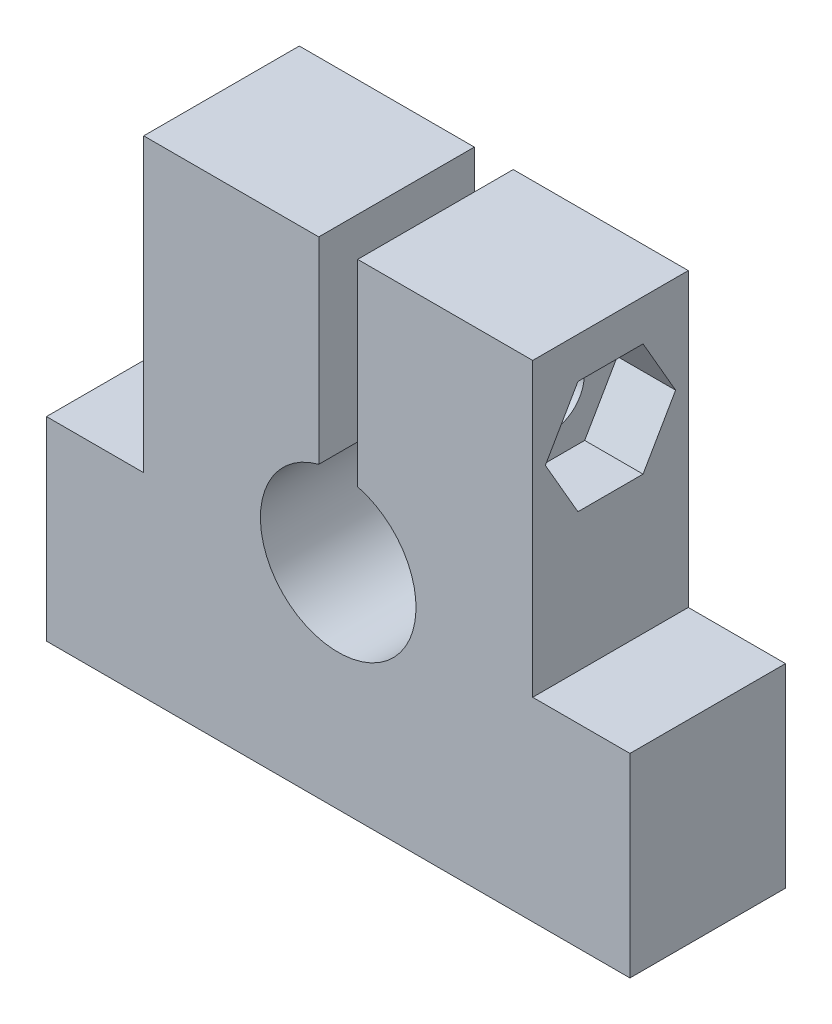
ISO-10303-21;
HEADER;
FILE_DESCRIPTION(('STEP AP214'),'2;1');
FILE_NAME('part.step','',(''),(''),'','','');
FILE_SCHEMA(('AUTOMOTIVE_DESIGN { 1 0 10303 214 1 1 1 1 }'));
ENDSEC;
DATA;
#1=APPLICATION_CONTEXT('core data for automotive mechanical design processes');
#2=APPLICATION_PROTOCOL_DEFINITION('international standard','automotive_design',2000,#1);
#3=PRODUCT_CONTEXT('',#1,'mechanical');
#4=PRODUCT('Part','Part','',(#3));
#5=PRODUCT_RELATED_PRODUCT_CATEGORY('part','',(#4));
#6=PRODUCT_DEFINITION_FORMATION('','',#4);
#7=PRODUCT_DEFINITION_CONTEXT('part definition',#1,'design');
#8=PRODUCT_DEFINITION('design','',#6,#7);
#9=PRODUCT_DEFINITION_SHAPE('','',#8);
#10=(LENGTH_UNIT() NAMED_UNIT(*) SI_UNIT(.MILLI.,.METRE.));
#11=(NAMED_UNIT(*) PLANE_ANGLE_UNIT() SI_UNIT($,.RADIAN.));
#12=(NAMED_UNIT(*) SI_UNIT($,.STERADIAN.) SOLID_ANGLE_UNIT());
#13=UNCERTAINTY_MEASURE_WITH_UNIT(LENGTH_MEASURE(1.E-05),#10,'distance_accuracy_value','');
#14=(GEOMETRIC_REPRESENTATION_CONTEXT(3) GLOBAL_UNCERTAINTY_ASSIGNED_CONTEXT((#13)) GLOBAL_UNIT_ASSIGNED_CONTEXT((#10,
#11,#12)) REPRESENTATION_CONTEXT('',''));
#15=CARTESIAN_POINT('',(0.,0.,0.));
#16=DIRECTION('',(0.,0.,1.));
#17=DIRECTION('',(1.,0.,0.));
#18=AXIS2_PLACEMENT_3D('',#15,#16,#17);
#19=CARTESIAN_POINT('',(15.,20.,4.));
#20=DIRECTION('',(-1.,0.,0.));
#21=DIRECTION('',(0.,-1.,0.));
#22=AXIS2_PLACEMENT_3D('',#19,#20,#21);
#23=CYLINDRICAL_SURFACE('',#22,1.65);
#24=CARTESIAN_POINT('',(0.999999999999999,20.,4.));
#25=DIRECTION('',(1.,0.,0.));
#26=DIRECTION('',(0.,1.,0.));
#27=AXIS2_PLACEMENT_3D('',#24,#25,#26);
#28=CIRCLE('',#27,1.65);
#29=CARTESIAN_POINT('',(0.999999999999999,21.65,4.));
#30=VERTEX_POINT('',#29);
#31=EDGE_CURVE('E224',#30,#30,#28,.T.);
#32=ORIENTED_EDGE('',*,*,#31,.F.);
#33=EDGE_LOOP('',(#32));
#34=FACE_BOUND('',#33,.T.);
#35=CARTESIAN_POINT('',(7.,20.,4.));
#36=DIRECTION('',(1.,0.,0.));
#37=DIRECTION('',(0.,0.,-1.));
#38=AXIS2_PLACEMENT_3D('',#35,#36,#37);
#39=CIRCLE('',#38,1.65);
#40=CARTESIAN_POINT('',(7.,20.,2.35));
#41=VERTEX_POINT('',#40);
#42=EDGE_CURVE('E39',#41,#41,#39,.F.);
#43=ORIENTED_EDGE('',*,*,#42,.F.);
#44=EDGE_LOOP('',(#43));
#45=FACE_BOUND('',#44,.T.);
#46=ADVANCED_FACE('F35',(#34,#45),#23,.F.);
#47=CARTESIAN_POINT('',(-0.999999999999999,20.,4.));
#48=DIRECTION('',(-1.,0.,0.));
#49=DIRECTION('',(0.,-1.,0.));
#50=AXIS2_PLACEMENT_3D('',#47,#48,#49);
#51=CIRCLE('',#50,1.65);
#52=CARTESIAN_POINT('',(-0.999999999999999,18.35,4.));
#53=VERTEX_POINT('',#52);
#54=EDGE_CURVE('E228',#53,#53,#51,.T.);
#55=ORIENTED_EDGE('',*,*,#54,.F.);
#56=EDGE_LOOP('',(#55));
#57=FACE_BOUND('',#56,.T.);
#58=CARTESIAN_POINT('',(-6.7,20.,4.));
#59=DIRECTION('',(-1.,0.,0.));
#60=DIRECTION('',(0.,-1.,0.));
#61=AXIS2_PLACEMENT_3D('',#58,#59,#60);
#62=CIRCLE('',#61,1.65);
#63=CARTESIAN_POINT('',(-6.7,18.35,4.));
#64=VERTEX_POINT('',#63);
#65=EDGE_CURVE('E220',#64,#64,#62,.F.);
#66=ORIENTED_EDGE('',*,*,#65,.F.);
#67=EDGE_LOOP('',(#66));
#68=FACE_BOUND('',#67,.T.);
#69=ADVANCED_FACE('F316',(#57,#68),#23,.F.);
#70=CARTESIAN_POINT('',(-10.,25.,8.));
#71=DIRECTION('',(0.,-1.,0.));
#72=DIRECTION('',(0.,0.,-1.));
#73=AXIS2_PLACEMENT_3D('',#70,#71,#72);
#74=PLANE('',#73);
#75=DIRECTION('',(-1.,0.,0.));
#76=VECTOR('',#75,1.);
#77=CARTESIAN_POINT('',(-10.,25.,0.));
#78=LINE('',#77,#76);
#79=CARTESIAN_POINT('',(10.,25.,0.));
#80=VERTEX_POINT('',#79);
#81=CARTESIAN_POINT('',(1.,25.,0.));
#82=VERTEX_POINT('',#81);
#83=EDGE_CURVE('E277',#80,#82,#78,.T.);
#84=ORIENTED_EDGE('',*,*,#83,.T.);
#85=DIRECTION('',(0.,0.,1.));
#86=VECTOR('',#85,1.);
#87=CARTESIAN_POINT('',(1.,25.,0.));
#88=LINE('',#87,#86);
#89=CARTESIAN_POINT('',(1.,25.,8.));
#90=VERTEX_POINT('',#89);
#91=EDGE_CURVE('E237',#82,#90,#88,.T.);
#92=ORIENTED_EDGE('',*,*,#91,.T.);
#93=DIRECTION('',(-1.,0.,0.));
#94=VECTOR('',#93,1.);
#95=CARTESIAN_POINT('',(-10.,25.,8.));
#96=LINE('',#95,#94);
#97=CARTESIAN_POINT('',(10.,25.,8.));
#98=VERTEX_POINT('',#97);
#99=EDGE_CURVE('E258',#98,#90,#96,.T.);
#100=ORIENTED_EDGE('',*,*,#99,.F.);
#101=DIRECTION('',(0.,0.,-1.));
#102=VECTOR('',#101,1.);
#103=CARTESIAN_POINT('',(10.,25.,8.));
#104=LINE('',#103,#102);
#105=EDGE_CURVE('E11',#98,#80,#104,.T.);
#106=ORIENTED_EDGE('',*,*,#105,.T.);
#107=EDGE_LOOP('',(#84,#92,#100,#106));
#108=FACE_BOUND('',#107,.T.);
#109=ADVANCED_FACE('F318',(#108),#74,.F.);
#110=CARTESIAN_POINT('',(10.,25.,8.));
#111=DIRECTION('',(-1.,0.,0.));
#112=DIRECTION('',(0.,-1.,0.));
#113=AXIS2_PLACEMENT_3D('',#110,#111,#112);
#114=PLANE('',#113);
#115=DIRECTION('',(0.,-0.866025403784438,-0.500000000000001));
#116=VECTOR('',#115,1.);
#117=CARTESIAN_POINT('',(10.,20.,7.34863156129983));
#118=LINE('',#117,#116);
#119=CARTESIAN_POINT('',(10.,20.,7.34863156129983));
#120=VERTEX_POINT('',#119);
#121=CARTESIAN_POINT('',(10.,17.1,5.67431578064992));
#122=VERTEX_POINT('',#121);
#123=EDGE_CURVE('E198',#120,#122,#118,.T.);
#124=ORIENTED_EDGE('',*,*,#123,.F.);
#125=DIRECTION('',(0.,-0.866025403784438,0.5));
#126=VECTOR('',#125,1.);
#127=CARTESIAN_POINT('',(10.,22.9,5.67431578064992));
#128=LINE('',#127,#126);
#129=CARTESIAN_POINT('',(10.,22.9,5.67431578064992));
#130=VERTEX_POINT('',#129);
#131=EDGE_CURVE('E52',#130,#120,#128,.T.);
#132=ORIENTED_EDGE('',*,*,#131,.F.);
#133=DIRECTION('',(0.,0.,1.));
#134=VECTOR('',#133,1.);
#135=CARTESIAN_POINT('',(10.,22.9,2.32568421935008));
#136=LINE('',#135,#134);
#137=CARTESIAN_POINT('',(10.,22.9,2.32568421935008));
#138=VERTEX_POINT('',#137);
#139=EDGE_CURVE('E184',#138,#130,#136,.T.);
#140=ORIENTED_EDGE('',*,*,#139,.F.);
#141=DIRECTION('',(0.,0.866025403784438,0.500000000000001));
#142=VECTOR('',#141,1.);
#143=CARTESIAN_POINT('',(10.,20.,0.651368438700171));
#144=LINE('',#143,#142);
#145=CARTESIAN_POINT('',(10.,20.,0.651368438700171));
#146=VERTEX_POINT('',#145);
#147=EDGE_CURVE('E187',#146,#138,#144,.T.);
#148=ORIENTED_EDGE('',*,*,#147,.F.);
#149=DIRECTION('',(0.,0.866025403784439,-0.5));
#150=VECTOR('',#149,1.);
#151=CARTESIAN_POINT('',(10.,17.1,2.32568421935008));
#152=LINE('',#151,#150);
#153=CARTESIAN_POINT('',(10.,17.1,2.32568421935008));
#154=VERTEX_POINT('',#153);
#155=EDGE_CURVE('E203',#154,#146,#152,.T.);
#156=ORIENTED_EDGE('',*,*,#155,.F.);
#157=DIRECTION('',(0.,0.,-1.));
#158=VECTOR('',#157,1.);
#159=CARTESIAN_POINT('',(10.,17.1,5.67431578064992));
#160=LINE('',#159,#158);
#161=EDGE_CURVE('E200',#122,#154,#160,.T.);
#162=ORIENTED_EDGE('',*,*,#161,.F.);
#163=EDGE_LOOP('',(#124,#132,#140,#148,#156,#162));
#164=FACE_BOUND('',#163,.T.);
#165=DIRECTION('',(0.,1.,0.));
#166=VECTOR('',#165,1.);
#167=CARTESIAN_POINT('',(10.,25.,0.));
#168=LINE('',#167,#166);
#169=CARTESIAN_POINT('',(10.,10.,0.));
#170=VERTEX_POINT('',#169);
#171=EDGE_CURVE('E246',#170,#80,#168,.T.);
#172=ORIENTED_EDGE('',*,*,#171,.T.);
#173=ORIENTED_EDGE('',*,*,#105,.F.);
#174=DIRECTION('',(0.,1.,0.));
#175=VECTOR('',#174,1.);
#176=CARTESIAN_POINT('',(10.,25.,8.));
#177=LINE('',#176,#175);
#178=CARTESIAN_POINT('',(10.,10.,8.));
#179=VERTEX_POINT('',#178);
#180=EDGE_CURVE('E253',#179,#98,#177,.T.);
#181=ORIENTED_EDGE('',*,*,#180,.F.);
#182=DIRECTION('',(0.,0.,-1.));
#183=VECTOR('',#182,1.);
#184=CARTESIAN_POINT('',(10.,10.,8.));
#185=LINE('',#184,#183);
#186=EDGE_CURVE('E273',#179,#170,#185,.T.);
#187=ORIENTED_EDGE('',*,*,#186,.T.);
#188=EDGE_LOOP('',(#172,#173,#181,#187));
#189=FACE_BOUND('',#188,.T.);
#190=ADVANCED_FACE('F37',(#164,#189),#114,.F.);
#191=CARTESIAN_POINT('',(-1.,25.,8.));
#192=VERTEX_POINT('',#191);
#193=CARTESIAN_POINT('',(-10.,25.,8.));
#194=VERTEX_POINT('',#193);
#195=EDGE_CURVE('E256',#192,#194,#96,.T.);
#196=ORIENTED_EDGE('',*,*,#195,.F.);
#197=DIRECTION('',(0.,0.,1.));
#198=VECTOR('',#197,1.);
#199=CARTESIAN_POINT('',(-1.,25.,0.));
#200=LINE('',#199,#198);
#201=CARTESIAN_POINT('',(-1.,25.,0.));
#202=VERTEX_POINT('',#201);
#203=EDGE_CURVE('E249',#202,#192,#200,.T.);
#204=ORIENTED_EDGE('',*,*,#203,.F.);
#205=CARTESIAN_POINT('',(-10.,25.,0.));
#206=VERTEX_POINT('',#205);
#207=EDGE_CURVE('E276',#202,#206,#78,.T.);
#208=ORIENTED_EDGE('',*,*,#207,.T.);
#209=DIRECTION('',(0.,0.,-1.));
#210=VECTOR('',#209,1.);
#211=CARTESIAN_POINT('',(-10.,25.,8.));
#212=LINE('',#211,#210);
#213=EDGE_CURVE('E44',#194,#206,#212,.T.);
#214=ORIENTED_EDGE('',*,*,#213,.F.);
#215=EDGE_LOOP('',(#196,#204,#208,#214));
#216=FACE_BOUND('',#215,.T.);
#217=ADVANCED_FACE('F326',(#216),#74,.F.);
#218=CARTESIAN_POINT('',(-10.,25.,8.));
#219=DIRECTION('',(1.,0.,0.));
#220=DIRECTION('',(0.,1.,0.));
#221=AXIS2_PLACEMENT_3D('',#218,#219,#220);
#222=PLANE('',#221);
#223=CARTESIAN_POINT('',(-10.,20.,4.));
#224=DIRECTION('',(-1.,0.,0.));
#225=DIRECTION('',(0.,-1.,0.));
#226=AXIS2_PLACEMENT_3D('',#223,#224,#225);
#227=CIRCLE('',#226,3.);
#228=CARTESIAN_POINT('',(-10.,17.,4.));
#229=VERTEX_POINT('',#228);
#230=EDGE_CURVE('E221',#229,#229,#227,.T.);
#231=ORIENTED_EDGE('',*,*,#230,.F.);
#232=EDGE_LOOP('',(#231));
#233=FACE_BOUND('',#232,.T.);
#234=DIRECTION('',(0.,-1.,0.));
#235=VECTOR('',#234,1.);
#236=CARTESIAN_POINT('',(-10.,25.,0.));
#237=LINE('',#236,#235);
#238=CARTESIAN_POINT('',(-10.,10.,0.));
#239=VERTEX_POINT('',#238);
#240=EDGE_CURVE('E280',#206,#239,#237,.T.);
#241=ORIENTED_EDGE('',*,*,#240,.T.);
#242=DIRECTION('',(0.,0.,-1.));
#243=VECTOR('',#242,1.);
#244=CARTESIAN_POINT('',(-10.,10.,8.));
#245=LINE('',#244,#243);
#246=CARTESIAN_POINT('',(-10.,10.,8.));
#247=VERTEX_POINT('',#246);
#248=EDGE_CURVE('E305',#247,#239,#245,.T.);
#249=ORIENTED_EDGE('',*,*,#248,.F.);
#250=DIRECTION('',(0.,-1.,0.));
#251=VECTOR('',#250,1.);
#252=CARTESIAN_POINT('',(-10.,25.,8.));
#253=LINE('',#252,#251);
#254=EDGE_CURVE('E261',#194,#247,#253,.T.);
#255=ORIENTED_EDGE('',*,*,#254,.F.);
#256=ORIENTED_EDGE('',*,*,#213,.T.);
#257=EDGE_LOOP('',(#241,#249,#255,#256));
#258=FACE_BOUND('',#257,.T.);
#259=ADVANCED_FACE('F371',(#233,#258),#222,.F.);
#260=CARTESIAN_POINT('',(-10.,10.,8.));
#261=DIRECTION('',(0.,-1.,0.));
#262=DIRECTION('',(0.,0.,-1.));
#263=AXIS2_PLACEMENT_3D('',#260,#261,#262);
#264=PLANE('',#263);
#265=DIRECTION('',(-1.,0.,0.));
#266=VECTOR('',#265,1.);
#267=CARTESIAN_POINT('',(-10.,10.,0.));
#268=LINE('',#267,#266);
#269=CARTESIAN_POINT('',(-15.,10.,0.));
#270=VERTEX_POINT('',#269);
#271=EDGE_CURVE('E282',#239,#270,#268,.T.);
#272=ORIENTED_EDGE('',*,*,#271,.T.);
#273=DIRECTION('',(0.,0.,-1.));
#274=VECTOR('',#273,1.);
#275=CARTESIAN_POINT('',(-15.,10.,8.));
#276=LINE('',#275,#274);
#277=CARTESIAN_POINT('',(-15.,10.,8.));
#278=VERTEX_POINT('',#277);
#279=EDGE_CURVE('E302',#278,#270,#276,.T.);
#280=ORIENTED_EDGE('',*,*,#279,.F.);
#281=DIRECTION('',(-1.,0.,0.));
#282=VECTOR('',#281,1.);
#283=CARTESIAN_POINT('',(-10.,10.,8.));
#284=LINE('',#283,#282);
#285=EDGE_CURVE('E263',#247,#278,#284,.T.);
#286=ORIENTED_EDGE('',*,*,#285,.F.);
#287=ORIENTED_EDGE('',*,*,#248,.T.);
#288=EDGE_LOOP('',(#272,#280,#286,#287));
#289=FACE_BOUND('',#288,.T.);
#290=ADVANCED_FACE('F367',(#289),#264,.F.);
#291=CARTESIAN_POINT('',(-15.,10.,8.));
#292=DIRECTION('',(1.,0.,0.));
#293=DIRECTION('',(0.,1.,0.));
#294=AXIS2_PLACEMENT_3D('',#291,#292,#293);
#295=PLANE('',#294);
#296=DIRECTION('',(0.,-1.,0.));
#297=VECTOR('',#296,1.);
#298=CARTESIAN_POINT('',(-15.,10.,0.));
#299=LINE('',#298,#297);
#300=CARTESIAN_POINT('',(-15.,0.,0.));
#301=VERTEX_POINT('',#300);
#302=EDGE_CURVE('E284',#270,#301,#299,.T.);
#303=ORIENTED_EDGE('',*,*,#302,.T.);
#304=DIRECTION('',(0.,0.,-1.));
#305=VECTOR('',#304,1.);
#306=CARTESIAN_POINT('',(-15.,0.,8.));
#307=LINE('',#306,#305);
#308=CARTESIAN_POINT('',(-15.,0.,8.));
#309=VERTEX_POINT('',#308);
#310=EDGE_CURVE('E299',#309,#301,#307,.T.);
#311=ORIENTED_EDGE('',*,*,#310,.F.);
#312=DIRECTION('',(0.,-1.,0.));
#313=VECTOR('',#312,1.);
#314=CARTESIAN_POINT('',(-15.,10.,8.));
#315=LINE('',#314,#313);
#316=EDGE_CURVE('E265',#278,#309,#315,.T.);
#317=ORIENTED_EDGE('',*,*,#316,.F.);
#318=ORIENTED_EDGE('',*,*,#279,.T.);
#319=EDGE_LOOP('',(#303,#311,#317,#318));
#320=FACE_BOUND('',#319,.T.);
#321=ADVANCED_FACE('F363',(#320),#295,.F.);
#322=CARTESIAN_POINT('',(15.,0.,8.));
#323=DIRECTION('',(0.,1.,0.));
#324=DIRECTION('',(0.,0.,1.));
#325=AXIS2_PLACEMENT_3D('',#322,#323,#324);
#326=PLANE('',#325);
#327=DIRECTION('',(1.,0.,0.));
#328=VECTOR('',#327,1.);
#329=CARTESIAN_POINT('',(15.,0.,0.));
#330=LINE('',#329,#328);
#331=CARTESIAN_POINT('',(15.,0.,0.));
#332=VERTEX_POINT('',#331);
#333=EDGE_CURVE('E286',#301,#332,#330,.T.);
#334=ORIENTED_EDGE('',*,*,#333,.T.);
#335=DIRECTION('',(0.,0.,-1.));
#336=VECTOR('',#335,1.);
#337=CARTESIAN_POINT('',(15.,0.,8.));
#338=LINE('',#337,#336);
#339=CARTESIAN_POINT('',(15.,0.,8.));
#340=VERTEX_POINT('',#339);
#341=EDGE_CURVE('E296',#340,#332,#338,.T.);
#342=ORIENTED_EDGE('',*,*,#341,.F.);
#343=DIRECTION('',(1.,0.,0.));
#344=VECTOR('',#343,1.);
#345=CARTESIAN_POINT('',(15.,0.,8.));
#346=LINE('',#345,#344);
#347=EDGE_CURVE('E267',#309,#340,#346,.T.);
#348=ORIENTED_EDGE('',*,*,#347,.F.);
#349=ORIENTED_EDGE('',*,*,#310,.T.);
#350=EDGE_LOOP('',(#334,#342,#348,#349));
#351=FACE_BOUND('',#350,.T.);
#352=ADVANCED_FACE('F359',(#351),#326,.F.);
#353=CARTESIAN_POINT('',(15.,10.,8.));
#354=DIRECTION('',(-1.,0.,0.));
#355=DIRECTION('',(0.,-1.,0.));
#356=AXIS2_PLACEMENT_3D('',#353,#354,#355);
#357=PLANE('',#356);
#358=DIRECTION('',(0.,1.,0.));
#359=VECTOR('',#358,1.);
#360=CARTESIAN_POINT('',(15.,10.,0.));
#361=LINE('',#360,#359);
#362=CARTESIAN_POINT('',(15.,10.,0.));
#363=VERTEX_POINT('',#362);
#364=EDGE_CURVE('E288',#332,#363,#361,.T.);
#365=ORIENTED_EDGE('',*,*,#364,.T.);
#366=DIRECTION('',(0.,0.,-1.));
#367=VECTOR('',#366,1.);
#368=CARTESIAN_POINT('',(15.,10.,8.));
#369=LINE('',#368,#367);
#370=CARTESIAN_POINT('',(15.,10.,8.));
#371=VERTEX_POINT('',#370);
#372=EDGE_CURVE('E293',#371,#363,#369,.T.);
#373=ORIENTED_EDGE('',*,*,#372,.F.);
#374=DIRECTION('',(0.,1.,0.));
#375=VECTOR('',#374,1.);
#376=CARTESIAN_POINT('',(15.,10.,8.));
#377=LINE('',#376,#375);
#378=EDGE_CURVE('E269',#340,#371,#377,.T.);
#379=ORIENTED_EDGE('',*,*,#378,.F.);
#380=ORIENTED_EDGE('',*,*,#341,.T.);
#381=EDGE_LOOP('',(#365,#373,#379,#380));
#382=FACE_BOUND('',#381,.T.);
#383=ADVANCED_FACE('F355',(#382),#357,.F.);
#384=CARTESIAN_POINT('',(10.,10.,8.));
#385=DIRECTION('',(0.,-1.,0.));
#386=DIRECTION('',(0.,0.,-1.));
#387=AXIS2_PLACEMENT_3D('',#384,#385,#386);
#388=PLANE('',#387);
#389=DIRECTION('',(-1.,0.,0.));
#390=VECTOR('',#389,1.);
#391=CARTESIAN_POINT('',(10.,10.,0.));
#392=LINE('',#391,#390);
#393=EDGE_CURVE('E257',#363,#170,#392,.T.);
#394=ORIENTED_EDGE('',*,*,#393,.T.);
#395=ORIENTED_EDGE('',*,*,#186,.F.);
#396=DIRECTION('',(-1.,0.,0.));
#397=VECTOR('',#396,1.);
#398=CARTESIAN_POINT('',(10.,10.,8.));
#399=LINE('',#398,#397);
#400=EDGE_CURVE('E271',#371,#179,#399,.T.);
#401=ORIENTED_EDGE('',*,*,#400,.F.);
#402=ORIENTED_EDGE('',*,*,#372,.T.);
#403=EDGE_LOOP('',(#394,#395,#401,#402));
#404=FACE_BOUND('',#403,.T.);
#405=ADVANCED_FACE('F348',(#404),#388,.F.);
#406=CARTESIAN_POINT('',(0.,0.,8.));
#407=DIRECTION('',(0.,0.,1.));
#408=DIRECTION('',(1.,0.,0.));
#409=AXIS2_PLACEMENT_3D('',#406,#407,#408);
#410=PLANE('',#409);
#411=DIRECTION('',(0.,1.,0.));
#412=VECTOR('',#411,1.);
#413=CARTESIAN_POINT('',(1.,25.,8.));
#414=LINE('',#413,#412);
#415=CARTESIAN_POINT('',(0.999999999999997,14.8729833462074,8.));
#416=VERTEX_POINT('',#415);
#417=EDGE_CURVE('E227',#416,#90,#414,.T.);
#418=ORIENTED_EDGE('',*,*,#417,.F.);
#419=CARTESIAN_POINT('',(0.,11.,8.));
#420=DIRECTION('',(0.,0.,1.));
#421=DIRECTION('',(1.,0.,0.));
#422=AXIS2_PLACEMENT_3D('',#419,#420,#421);
#423=CIRCLE('',#422,4.);
#424=CARTESIAN_POINT('',(-0.999999999999999,14.8729833462074,8.));
#425=VERTEX_POINT('',#424);
#426=EDGE_CURVE('E233',#425,#416,#423,.T.);
#427=ORIENTED_EDGE('',*,*,#426,.F.);
#428=DIRECTION('',(0.,-1.,0.));
#429=VECTOR('',#428,1.);
#430=CARTESIAN_POINT('',(-1.,25.,8.));
#431=LINE('',#430,#429);
#432=EDGE_CURVE('E239',#192,#425,#431,.T.);
#433=ORIENTED_EDGE('',*,*,#432,.F.);
#434=ORIENTED_EDGE('',*,*,#195,.T.);
#435=ORIENTED_EDGE('',*,*,#254,.T.);
#436=ORIENTED_EDGE('',*,*,#285,.T.);
#437=ORIENTED_EDGE('',*,*,#316,.T.);
#438=ORIENTED_EDGE('',*,*,#347,.T.);
#439=ORIENTED_EDGE('',*,*,#378,.T.);
#440=ORIENTED_EDGE('',*,*,#400,.T.);
#441=ORIENTED_EDGE('',*,*,#180,.T.);
#442=ORIENTED_EDGE('',*,*,#99,.T.);
#443=EDGE_LOOP('',(#418,#427,#433,#434,#435,#436,#437,#438,#439,#440,#441,#442));
#444=FACE_BOUND('',#443,.T.);
#445=ADVANCED_FACE('F345',(#444),#410,.T.);
#446=CARTESIAN_POINT('',(0.,0.,0.));
#447=DIRECTION('',(0.,0.,1.));
#448=DIRECTION('',(1.,0.,0.));
#449=AXIS2_PLACEMENT_3D('',#446,#447,#448);
#450=PLANE('',#449);
#451=CARTESIAN_POINT('',(0.,11.,0.));
#452=DIRECTION('',(0.,0.,1.));
#453=DIRECTION('',(1.,0.,0.));
#454=AXIS2_PLACEMENT_3D('',#451,#452,#453);
#455=CIRCLE('',#454,4.);
#456=CARTESIAN_POINT('',(-0.999999999999999,14.8729833462074,0.));
#457=VERTEX_POINT('',#456);
#458=CARTESIAN_POINT('',(0.999999999999997,14.8729833462074,0.));
#459=VERTEX_POINT('',#458);
#460=EDGE_CURVE('E60',#457,#459,#455,.T.);
#461=ORIENTED_EDGE('',*,*,#460,.T.);
#462=DIRECTION('',(0.,1.,0.));
#463=VECTOR('',#462,1.);
#464=CARTESIAN_POINT('',(1.,25.,0.));
#465=LINE('',#464,#463);
#466=EDGE_CURVE('E229',#459,#82,#465,.T.);
#467=ORIENTED_EDGE('',*,*,#466,.T.);
#468=ORIENTED_EDGE('',*,*,#83,.F.);
#469=ORIENTED_EDGE('',*,*,#171,.F.);
#470=ORIENTED_EDGE('',*,*,#393,.F.);
#471=ORIENTED_EDGE('',*,*,#364,.F.);
#472=ORIENTED_EDGE('',*,*,#333,.F.);
#473=ORIENTED_EDGE('',*,*,#302,.F.);
#474=ORIENTED_EDGE('',*,*,#271,.F.);
#475=ORIENTED_EDGE('',*,*,#240,.F.);
#476=ORIENTED_EDGE('',*,*,#207,.F.);
#477=DIRECTION('',(0.,-1.,0.));
#478=VECTOR('',#477,1.);
#479=CARTESIAN_POINT('',(-1.,25.,0.));
#480=LINE('',#479,#478);
#481=EDGE_CURVE('E232',#202,#457,#480,.T.);
#482=ORIENTED_EDGE('',*,*,#481,.T.);
#483=EDGE_LOOP('',(#461,#467,#468,#469,#470,#471,#472,#473,#474,#475,#476,#482));
#484=FACE_BOUND('',#483,.T.);
#485=ADVANCED_FACE('F343',(#484),#450,.F.);
#486=CARTESIAN_POINT('',(1.,25.,0.));
#487=DIRECTION('',(1.,0.,0.));
#488=DIRECTION('',(0.,1.,0.));
#489=AXIS2_PLACEMENT_3D('',#486,#487,#488);
#490=PLANE('',#489);
#491=ORIENTED_EDGE('',*,*,#31,.T.);
#492=EDGE_LOOP('',(#491));
#493=FACE_BOUND('',#492,.T.);
#494=ORIENTED_EDGE('',*,*,#417,.T.);
#495=ORIENTED_EDGE('',*,*,#91,.F.);
#496=ORIENTED_EDGE('',*,*,#466,.F.);
#497=DIRECTION('',(0.,0.,1.));
#498=VECTOR('',#497,1.);
#499=CARTESIAN_POINT('',(0.999999999999997,14.8729833462074,0.));
#500=LINE('',#499,#498);
#501=EDGE_CURVE('E244',#459,#416,#500,.T.);
#502=ORIENTED_EDGE('',*,*,#501,.T.);
#503=EDGE_LOOP('',(#494,#495,#496,#502));
#504=FACE_BOUND('',#503,.T.);
#505=ADVANCED_FACE('F337',(#493,#504),#490,.F.);
#506=CARTESIAN_POINT('',(0.,11.,0.));
#507=DIRECTION('',(0.,0.,1.));
#508=DIRECTION('',(1.,0.,0.));
#509=AXIS2_PLACEMENT_3D('',#506,#507,#508);
#510=CYLINDRICAL_SURFACE('',#509,4.);
#511=ORIENTED_EDGE('',*,*,#426,.T.);
#512=ORIENTED_EDGE('',*,*,#501,.F.);
#513=ORIENTED_EDGE('',*,*,#460,.F.);
#514=DIRECTION('',(0.,0.,1.));
#515=VECTOR('',#514,1.);
#516=CARTESIAN_POINT('',(-0.999999999999999,14.8729833462074,0.));
#517=LINE('',#516,#515);
#518=EDGE_CURVE('E247',#457,#425,#517,.T.);
#519=ORIENTED_EDGE('',*,*,#518,.T.);
#520=EDGE_LOOP('',(#511,#512,#513,#519));
#521=FACE_BOUND('',#520,.T.);
#522=ADVANCED_FACE('F333',(#521),#510,.F.);
#523=CARTESIAN_POINT('',(-1.,25.,0.));
#524=DIRECTION('',(-1.,0.,0.));
#525=DIRECTION('',(0.,-1.,0.));
#526=AXIS2_PLACEMENT_3D('',#523,#524,#525);
#527=PLANE('',#526);
#528=ORIENTED_EDGE('',*,*,#54,.T.);
#529=EDGE_LOOP('',(#528));
#530=FACE_BOUND('',#529,.T.);
#531=ORIENTED_EDGE('',*,*,#432,.T.);
#532=ORIENTED_EDGE('',*,*,#518,.F.);
#533=ORIENTED_EDGE('',*,*,#481,.F.);
#534=ORIENTED_EDGE('',*,*,#203,.T.);
#535=EDGE_LOOP('',(#531,#532,#533,#534));
#536=FACE_BOUND('',#535,.T.);
#537=ADVANCED_FACE('F336',(#530,#536),#527,.F.);
#538=CARTESIAN_POINT('',(-6.7,20.,4.));
#539=DIRECTION('',(-1.,0.,0.));
#540=DIRECTION('',(0.,-1.,0.));
#541=AXIS2_PLACEMENT_3D('',#538,#539,#540);
#542=PLANE('',#541);
#543=CARTESIAN_POINT('',(-6.7,20.,4.));
#544=DIRECTION('',(-1.,0.,0.));
#545=DIRECTION('',(0.,-1.,0.));
#546=AXIS2_PLACEMENT_3D('',#543,#544,#545);
#547=CIRCLE('',#546,3.);
#548=CARTESIAN_POINT('',(-6.7,17.,4.));
#549=VERTEX_POINT('',#548);
#550=EDGE_CURVE('E217',#549,#549,#547,.T.);
#551=ORIENTED_EDGE('',*,*,#550,.T.);
#552=EDGE_LOOP('',(#551));
#553=FACE_BOUND('',#552,.T.);
#554=ORIENTED_EDGE('',*,*,#65,.T.);
#555=EDGE_LOOP('',(#554));
#556=FACE_BOUND('',#555,.T.);
#557=ADVANCED_FACE('F314',(#553,#556),#542,.T.);
#558=CARTESIAN_POINT('',(-6.7,20.,4.));
#559=DIRECTION('',(-1.,0.,0.));
#560=DIRECTION('',(0.,-1.,0.));
#561=AXIS2_PLACEMENT_3D('',#558,#559,#560);
#562=CYLINDRICAL_SURFACE('',#561,3.);
#563=ORIENTED_EDGE('',*,*,#550,.F.);
#564=EDGE_LOOP('',(#563));
#565=FACE_BOUND('',#564,.T.);
#566=ORIENTED_EDGE('',*,*,#230,.T.);
#567=EDGE_LOOP('',(#566));
#568=FACE_BOUND('',#567,.T.);
#569=ADVANCED_FACE('F331',(#565,#568),#562,.F.);
#570=CARTESIAN_POINT('',(6.99999999999999,0.,0.));
#571=DIRECTION('',(1.,0.,0.));
#572=DIRECTION('',(0.,0.,-1.));
#573=AXIS2_PLACEMENT_3D('',#570,#571,#572);
#574=PLANE('',#573);
#575=DIRECTION('',(0.,-0.866025403784438,0.5));
#576=VECTOR('',#575,1.);
#577=CARTESIAN_POINT('',(7.,22.9,5.67431578064992));
#578=LINE('',#577,#576);
#579=CARTESIAN_POINT('',(7.,22.9,5.67431578064992));
#580=VERTEX_POINT('',#579);
#581=CARTESIAN_POINT('',(7.,20.,7.34863156129983));
#582=VERTEX_POINT('',#581);
#583=EDGE_CURVE('E164',#580,#582,#578,.T.);
#584=ORIENTED_EDGE('',*,*,#583,.T.);
#585=DIRECTION('',(0.,-0.866025403784438,-0.500000000000001));
#586=VECTOR('',#585,1.);
#587=CARTESIAN_POINT('',(7.,20.,7.34863156129983));
#588=LINE('',#587,#586);
#589=CARTESIAN_POINT('',(7.,17.1,5.67431578064992));
#590=VERTEX_POINT('',#589);
#591=EDGE_CURVE('E173',#582,#590,#588,.T.);
#592=ORIENTED_EDGE('',*,*,#591,.T.);
#593=DIRECTION('',(0.,0.,-1.));
#594=VECTOR('',#593,1.);
#595=CARTESIAN_POINT('',(7.,17.1,5.67431578064992));
#596=LINE('',#595,#594);
#597=CARTESIAN_POINT('',(7.,17.1,2.32568421935008));
#598=VERTEX_POINT('',#597);
#599=EDGE_CURVE('E178',#590,#598,#596,.T.);
#600=ORIENTED_EDGE('',*,*,#599,.T.);
#601=DIRECTION('',(0.,0.866025403784439,-0.5));
#602=VECTOR('',#601,1.);
#603=CARTESIAN_POINT('',(7.,17.1,2.32568421935008));
#604=LINE('',#603,#602);
#605=CARTESIAN_POINT('',(7.,20.,0.651368438700171));
#606=VERTEX_POINT('',#605);
#607=EDGE_CURVE('E191',#598,#606,#604,.T.);
#608=ORIENTED_EDGE('',*,*,#607,.T.);
#609=DIRECTION('',(0.,0.866025403784438,0.500000000000001));
#610=VECTOR('',#609,1.);
#611=CARTESIAN_POINT('',(7.,20.,0.651368438700171));
#612=LINE('',#611,#610);
#613=CARTESIAN_POINT('',(7.,22.9,2.32568421935008));
#614=VERTEX_POINT('',#613);
#615=EDGE_CURVE('E194',#606,#614,#612,.T.);
#616=ORIENTED_EDGE('',*,*,#615,.T.);
#617=DIRECTION('',(0.,0.,1.));
#618=VECTOR('',#617,1.);
#619=CARTESIAN_POINT('',(7.,22.9,2.32568421935008));
#620=LINE('',#619,#618);
#621=EDGE_CURVE('E170',#614,#580,#620,.T.);
#622=ORIENTED_EDGE('',*,*,#621,.T.);
#623=EDGE_LOOP('',(#584,#592,#600,#608,#616,#622));
#624=FACE_BOUND('',#623,.T.);
#625=ORIENTED_EDGE('',*,*,#42,.T.);
#626=EDGE_LOOP('',(#625));
#627=FACE_BOUND('',#626,.T.);
#628=ADVANCED_FACE('F180',(#624,#627),#574,.T.);
#629=CARTESIAN_POINT('',(7.,22.9,5.67431578064992));
#630=DIRECTION('',(0.,0.5,0.866025403784438));
#631=DIRECTION('',(0.,-0.866025403784439,0.5));
#632=AXIS2_PLACEMENT_3D('',#629,#630,#631);
#633=PLANE('',#632);
#634=ORIENTED_EDGE('',*,*,#131,.T.);
#635=DIRECTION('',(1.,0.,0.));
#636=VECTOR('',#635,1.);
#637=CARTESIAN_POINT('',(7.,20.,7.34863156129983));
#638=LINE('',#637,#636);
#639=EDGE_CURVE('E160',#582,#120,#638,.T.);
#640=ORIENTED_EDGE('',*,*,#639,.F.);
#641=ORIENTED_EDGE('',*,*,#583,.F.);
#642=DIRECTION('',(1.,0.,0.));
#643=VECTOR('',#642,1.);
#644=CARTESIAN_POINT('',(7.,22.9,5.67431578064992));
#645=LINE('',#644,#643);
#646=EDGE_CURVE('E208',#580,#130,#645,.T.);
#647=ORIENTED_EDGE('',*,*,#646,.T.);
#648=EDGE_LOOP('',(#634,#640,#641,#647));
#649=FACE_BOUND('',#648,.T.);
#650=ADVANCED_FACE('F162',(#649),#633,.F.);
#651=CARTESIAN_POINT('',(7.,22.9,2.32568421935008));
#652=DIRECTION('',(0.,1.,0.));
#653=DIRECTION('',(-1.,0.,0.));
#654=AXIS2_PLACEMENT_3D('',#651,#652,#653);
#655=PLANE('',#654);
#656=ORIENTED_EDGE('',*,*,#139,.T.);
#657=ORIENTED_EDGE('',*,*,#646,.F.);
#658=ORIENTED_EDGE('',*,*,#621,.F.);
#659=DIRECTION('',(1.,0.,0.));
#660=VECTOR('',#659,1.);
#661=CARTESIAN_POINT('',(7.,22.9,2.32568421935008));
#662=LINE('',#661,#660);
#663=EDGE_CURVE('E210',#614,#138,#662,.T.);
#664=ORIENTED_EDGE('',*,*,#663,.T.);
#665=EDGE_LOOP('',(#656,#657,#658,#664));
#666=FACE_BOUND('',#665,.T.);
#667=ADVANCED_FACE('F429',(#666),#655,.F.);
#668=CARTESIAN_POINT('',(7.,20.,0.651368438700171));
#669=DIRECTION('',(0.,0.500000000000001,-0.866025403784438));
#670=DIRECTION('',(0.,0.866025403784438,0.500000000000001));
#671=AXIS2_PLACEMENT_3D('',#668,#669,#670);
#672=PLANE('',#671);
#673=ORIENTED_EDGE('',*,*,#147,.T.);
#674=ORIENTED_EDGE('',*,*,#663,.F.);
#675=ORIENTED_EDGE('',*,*,#615,.F.);
#676=DIRECTION('',(1.,0.,0.));
#677=VECTOR('',#676,1.);
#678=CARTESIAN_POINT('',(7.,20.,0.651368438700171));
#679=LINE('',#678,#677);
#680=EDGE_CURVE('E212',#606,#146,#679,.T.);
#681=ORIENTED_EDGE('',*,*,#680,.T.);
#682=EDGE_LOOP('',(#673,#674,#675,#681));
#683=FACE_BOUND('',#682,.T.);
#684=ADVANCED_FACE('F427',(#683),#672,.F.);
#685=CARTESIAN_POINT('',(7.,17.1,2.32568421935008));
#686=DIRECTION('',(0.,-0.5,-0.866025403784439));
#687=DIRECTION('',(0.,0.866025403784439,-0.5));
#688=AXIS2_PLACEMENT_3D('',#685,#686,#687);
#689=PLANE('',#688);
#690=ORIENTED_EDGE('',*,*,#155,.T.);
#691=ORIENTED_EDGE('',*,*,#680,.F.);
#692=ORIENTED_EDGE('',*,*,#607,.F.);
#693=DIRECTION('',(1.,0.,0.));
#694=VECTOR('',#693,1.);
#695=CARTESIAN_POINT('',(7.,17.1,2.32568421935008));
#696=LINE('',#695,#694);
#697=EDGE_CURVE('E214',#598,#154,#696,.T.);
#698=ORIENTED_EDGE('',*,*,#697,.T.);
#699=EDGE_LOOP('',(#690,#691,#692,#698));
#700=FACE_BOUND('',#699,.T.);
#701=ADVANCED_FACE('F425',(#700),#689,.F.);
#702=CARTESIAN_POINT('',(7.,17.1,5.67431578064992));
#703=DIRECTION('',(0.,-1.,0.));
#704=DIRECTION('',(1.,0.,0.));
#705=AXIS2_PLACEMENT_3D('',#702,#703,#704);
#706=PLANE('',#705);
#707=ORIENTED_EDGE('',*,*,#161,.T.);
#708=ORIENTED_EDGE('',*,*,#697,.F.);
#709=ORIENTED_EDGE('',*,*,#599,.F.);
#710=DIRECTION('',(1.,0.,0.));
#711=VECTOR('',#710,1.);
#712=CARTESIAN_POINT('',(7.,17.1,5.67431578064992));
#713=LINE('',#712,#711);
#714=EDGE_CURVE('E169',#590,#122,#713,.T.);
#715=ORIENTED_EDGE('',*,*,#714,.T.);
#716=EDGE_LOOP('',(#707,#708,#709,#715));
#717=FACE_BOUND('',#716,.T.);
#718=ADVANCED_FACE('F421',(#717),#706,.F.);
#719=CARTESIAN_POINT('',(7.,20.,7.34863156129983));
#720=DIRECTION('',(0.,-0.500000000000001,0.866025403784438));
#721=DIRECTION('',(0.,-0.866025403784438,-0.500000000000001));
#722=AXIS2_PLACEMENT_3D('',#719,#720,#721);
#723=PLANE('',#722);
#724=ORIENTED_EDGE('',*,*,#123,.T.);
#725=ORIENTED_EDGE('',*,*,#714,.F.);
#726=ORIENTED_EDGE('',*,*,#591,.F.);
#727=ORIENTED_EDGE('',*,*,#639,.T.);
#728=EDGE_LOOP('',(#724,#725,#726,#727));
#729=FACE_BOUND('',#728,.T.);
#730=ADVANCED_FACE('F174',(#729),#723,.F.);
#731=CLOSED_SHELL('',(#46,#69,#109,#190,#217,#259,#290,#321,#352,#383,#405,#445,#485,#505,#522,
#537,#557,#569,#628,#650,#667,#684,#701,#718,#730));
#732=MANIFOLD_SOLID_BREP('B2',#731);
#733=ADVANCED_BREP_SHAPE_REPRESENTATION('',(#18,#732),#14);
#734=SHAPE_DEFINITION_REPRESENTATION(#9,#733);
ENDSEC;
END-ISO-10303-21;
